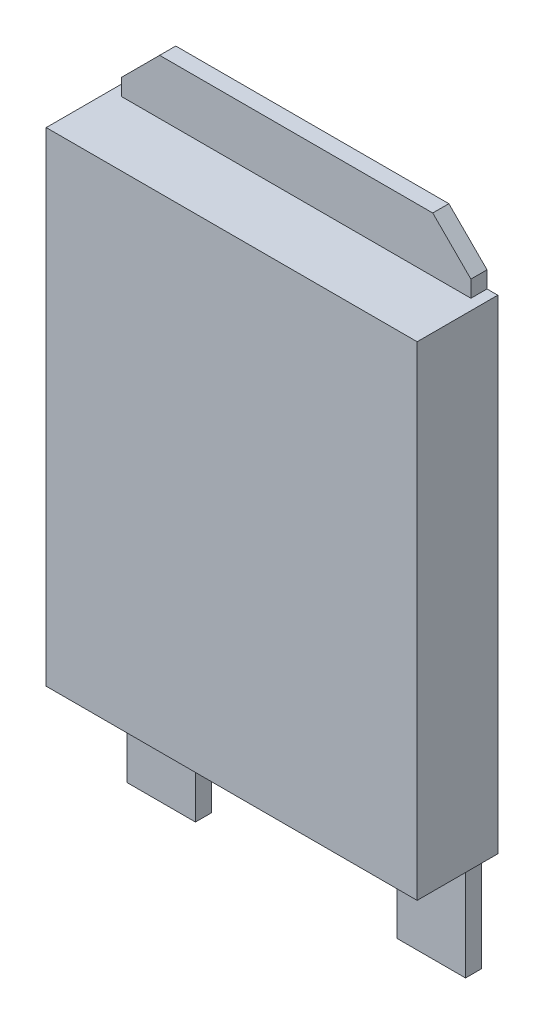
ISO-10303-21;
HEADER;
FILE_DESCRIPTION(('STEP AP214'),'2;1');
FILE_NAME('part.step','',(''),(''),'','','');
FILE_SCHEMA(('AUTOMOTIVE_DESIGN { 1 0 10303 214 1 1 1 1 }'));
ENDSEC;
DATA;
#1=APPLICATION_CONTEXT('core data for automotive mechanical design processes');
#2=APPLICATION_PROTOCOL_DEFINITION('international standard','automotive_design',2000,#1);
#3=PRODUCT_CONTEXT('',#1,'mechanical');
#4=PRODUCT('Part','Part','',(#3));
#5=PRODUCT_RELATED_PRODUCT_CATEGORY('part','',(#4));
#6=PRODUCT_DEFINITION_FORMATION('','',#4);
#7=PRODUCT_DEFINITION_CONTEXT('part definition',#1,'design');
#8=PRODUCT_DEFINITION('design','',#6,#7);
#9=PRODUCT_DEFINITION_SHAPE('','',#8);
#10=(LENGTH_UNIT() NAMED_UNIT(*) SI_UNIT(.MILLI.,.METRE.));
#11=(NAMED_UNIT(*) PLANE_ANGLE_UNIT() SI_UNIT($,.RADIAN.));
#12=(NAMED_UNIT(*) SI_UNIT($,.STERADIAN.) SOLID_ANGLE_UNIT());
#13=UNCERTAINTY_MEASURE_WITH_UNIT(LENGTH_MEASURE(1.E-05),#10,'distance_accuracy_value','');
#14=(GEOMETRIC_REPRESENTATION_CONTEXT(3) GLOBAL_UNCERTAINTY_ASSIGNED_CONTEXT((#13)) GLOBAL_UNIT_ASSIGNED_CONTEXT((#10,
#11,#12)) REPRESENTATION_CONTEXT('',''));
#15=CARTESIAN_POINT('',(0.,0.,0.));
#16=DIRECTION('',(0.,0.,1.));
#17=DIRECTION('',(1.,0.,0.));
#18=AXIS2_PLACEMENT_3D('',#15,#16,#17);
#19=CARTESIAN_POINT('',(-3.45,-4.5,1.5));
#20=DIRECTION('',(0.,1.,0.));
#21=DIRECTION('',(0.,0.,1.));
#22=AXIS2_PLACEMENT_3D('',#19,#20,#21);
#23=PLANE('',#22);
#24=DIRECTION('',(0.,0.,-1.));
#25=VECTOR('',#24,1.);
#26=CARTESIAN_POINT('',(-3.15,-4.5,0.3));
#27=LINE('',#26,#25);
#28=CARTESIAN_POINT('',(-3.15,-4.5,0.3));
#29=VERTEX_POINT('',#28);
#30=CARTESIAN_POINT('',(-3.15,-4.5,0.));
#31=VERTEX_POINT('',#30);
#32=EDGE_CURVE('E62',#29,#31,#27,.T.);
#33=ORIENTED_EDGE('',*,*,#32,.F.);
#34=DIRECTION('',(-1.,0.,0.));
#35=VECTOR('',#34,1.);
#36=CARTESIAN_POINT('',(-1.87383015994058,-4.5,0.3));
#37=LINE('',#36,#35);
#38=CARTESIAN_POINT('',(-1.87383015994058,-4.5,0.3));
#39=VERTEX_POINT('',#38);
#40=EDGE_CURVE('E57',#39,#29,#37,.T.);
#41=ORIENTED_EDGE('',*,*,#40,.F.);
#42=DIRECTION('',(0.,0.,-1.));
#43=VECTOR('',#42,1.);
#44=CARTESIAN_POINT('',(-1.87383015994058,-4.5,0.3));
#45=LINE('',#44,#43);
#46=CARTESIAN_POINT('',(-1.87383015994058,-4.5,0.));
#47=VERTEX_POINT('',#46);
#48=EDGE_CURVE('E196',#39,#47,#45,.T.);
#49=ORIENTED_EDGE('',*,*,#48,.T.);
#50=DIRECTION('',(1.,0.,0.));
#51=VECTOR('',#50,1.);
#52=CARTESIAN_POINT('',(-3.45,-4.5,0.));
#53=LINE('',#52,#51);
#54=CARTESIAN_POINT('',(1.87383015994058,-4.5,0.));
#55=VERTEX_POINT('',#54);
#56=EDGE_CURVE('E322',#47,#55,#53,.T.);
#57=ORIENTED_EDGE('',*,*,#56,.T.);
#58=DIRECTION('',(0.,0.,-1.));
#59=VECTOR('',#58,1.);
#60=CARTESIAN_POINT('',(1.87383015994058,-4.5,0.3));
#61=LINE('',#60,#59);
#62=CARTESIAN_POINT('',(1.87383015994058,-4.5,0.3));
#63=VERTEX_POINT('',#62);
#64=EDGE_CURVE('E230',#63,#55,#61,.T.);
#65=ORIENTED_EDGE('',*,*,#64,.F.);
#66=DIRECTION('',(-1.,0.,0.));
#67=VECTOR('',#66,1.);
#68=CARTESIAN_POINT('',(3.15,-4.5,0.3));
#69=LINE('',#68,#67);
#70=CARTESIAN_POINT('',(3.15,-4.5,0.3));
#71=VERTEX_POINT('',#70);
#72=EDGE_CURVE('E200',#71,#63,#69,.T.);
#73=ORIENTED_EDGE('',*,*,#72,.F.);
#74=DIRECTION('',(0.,0.,-1.));
#75=VECTOR('',#74,1.);
#76=CARTESIAN_POINT('',(3.15,-4.5,0.3));
#77=LINE('',#76,#75);
#78=CARTESIAN_POINT('',(3.15,-4.5,0.));
#79=VERTEX_POINT('',#78);
#80=EDGE_CURVE('E213',#71,#79,#77,.T.);
#81=ORIENTED_EDGE('',*,*,#80,.T.);
#82=CARTESIAN_POINT('',(3.45,-4.5,0.));
#83=VERTEX_POINT('',#82);
#84=EDGE_CURVE('E319',#79,#83,#53,.T.);
#85=ORIENTED_EDGE('',*,*,#84,.T.);
#86=DIRECTION('',(0.,0.,-1.));
#87=VECTOR('',#86,1.);
#88=CARTESIAN_POINT('',(3.45,-4.5,1.5));
#89=LINE('',#88,#87);
#90=CARTESIAN_POINT('',(3.45,-4.5,1.5));
#91=VERTEX_POINT('',#90);
#92=EDGE_CURVE('E307',#91,#83,#89,.T.);
#93=ORIENTED_EDGE('',*,*,#92,.F.);
#94=DIRECTION('',(1.,0.,0.));
#95=VECTOR('',#94,1.);
#96=CARTESIAN_POINT('',(-3.45,-4.5,1.5));
#97=LINE('',#96,#95);
#98=CARTESIAN_POINT('',(-3.45,-4.5,1.5));
#99=VERTEX_POINT('',#98);
#100=EDGE_CURVE('E304',#99,#91,#97,.T.);
#101=ORIENTED_EDGE('',*,*,#100,.F.);
#102=DIRECTION('',(0.,0.,-1.));
#103=VECTOR('',#102,1.);
#104=CARTESIAN_POINT('',(-3.45,-4.5,1.5));
#105=LINE('',#104,#103);
#106=CARTESIAN_POINT('',(-3.45,-4.5,0.));
#107=VERTEX_POINT('',#106);
#108=EDGE_CURVE('E326',#99,#107,#105,.T.);
#109=ORIENTED_EDGE('',*,*,#108,.T.);
#110=EDGE_CURVE('E298',#107,#31,#53,.T.);
#111=ORIENTED_EDGE('',*,*,#110,.T.);
#112=EDGE_LOOP('',(#33,#41,#49,#57,#65,#73,#81,#85,#93,#101,#109,#111));
#113=FACE_BOUND('',#112,.T.);
#114=ADVANCED_FACE('F41',(#113),#23,.F.);
#115=CARTESIAN_POINT('',(-3.45,4.5,1.5));
#116=DIRECTION('',(0.,-1.,0.));
#117=DIRECTION('',(0.,0.,-1.));
#118=AXIS2_PLACEMENT_3D('',#115,#116,#117);
#119=PLANE('',#118);
#120=DIRECTION('',(0.,0.,-1.));
#121=VECTOR('',#120,1.);
#122=CARTESIAN_POINT('',(3.25,4.5,0.3));
#123=LINE('',#122,#121);
#124=CARTESIAN_POINT('',(3.25,4.5,0.3));
#125=VERTEX_POINT('',#124);
#126=CARTESIAN_POINT('',(3.25,4.5,0.));
#127=VERTEX_POINT('',#126);
#128=EDGE_CURVE('E288',#125,#127,#123,.T.);
#129=ORIENTED_EDGE('',*,*,#128,.F.);
#130=DIRECTION('',(1.,0.,0.));
#131=VECTOR('',#130,1.);
#132=CARTESIAN_POINT('',(3.25,4.5,0.3));
#133=LINE('',#132,#131);
#134=CARTESIAN_POINT('',(-3.25,4.5,0.3));
#135=VERTEX_POINT('',#134);
#136=EDGE_CURVE('E235',#135,#125,#133,.T.);
#137=ORIENTED_EDGE('',*,*,#136,.F.);
#138=DIRECTION('',(0.,0.,-1.));
#139=VECTOR('',#138,1.);
#140=CARTESIAN_POINT('',(-3.25,4.5,0.3));
#141=LINE('',#140,#139);
#142=CARTESIAN_POINT('',(-3.25,4.5,0.));
#143=VERTEX_POINT('',#142);
#144=EDGE_CURVE('E255',#135,#143,#141,.T.);
#145=ORIENTED_EDGE('',*,*,#144,.T.);
#146=DIRECTION('',(-1.,0.,0.));
#147=VECTOR('',#146,1.);
#148=CARTESIAN_POINT('',(-3.45,4.5,0.));
#149=LINE('',#148,#147);
#150=CARTESIAN_POINT('',(-3.45,4.5,0.));
#151=VERTEX_POINT('',#150);
#152=EDGE_CURVE('E311',#143,#151,#149,.T.);
#153=ORIENTED_EDGE('',*,*,#152,.T.);
#154=DIRECTION('',(0.,0.,-1.));
#155=VECTOR('',#154,1.);
#156=CARTESIAN_POINT('',(-3.45,4.5,1.5));
#157=LINE('',#156,#155);
#158=CARTESIAN_POINT('',(-3.45,4.5,1.5));
#159=VERTEX_POINT('',#158);
#160=EDGE_CURVE('E50',#159,#151,#157,.T.);
#161=ORIENTED_EDGE('',*,*,#160,.F.);
#162=DIRECTION('',(-1.,0.,0.));
#163=VECTOR('',#162,1.);
#164=CARTESIAN_POINT('',(-3.45,4.5,1.5));
#165=LINE('',#164,#163);
#166=CARTESIAN_POINT('',(3.45,4.5,1.5));
#167=VERTEX_POINT('',#166);
#168=EDGE_CURVE('E297',#167,#159,#165,.T.);
#169=ORIENTED_EDGE('',*,*,#168,.F.);
#170=DIRECTION('',(0.,0.,-1.));
#171=VECTOR('',#170,1.);
#172=CARTESIAN_POINT('',(3.45,4.5,1.5));
#173=LINE('',#172,#171);
#174=CARTESIAN_POINT('',(3.45,4.5,0.));
#175=VERTEX_POINT('',#174);
#176=EDGE_CURVE('E11',#167,#175,#173,.T.);
#177=ORIENTED_EDGE('',*,*,#176,.T.);
#178=EDGE_CURVE('E312',#175,#127,#149,.T.);
#179=ORIENTED_EDGE('',*,*,#178,.T.);
#180=EDGE_LOOP('',(#129,#137,#145,#153,#161,#169,#177,#179));
#181=FACE_BOUND('',#180,.T.);
#182=ADVANCED_FACE('F384',(#181),#119,.F.);
#183=CARTESIAN_POINT('',(3.45,4.5,1.5));
#184=DIRECTION('',(-1.,0.,0.));
#185=DIRECTION('',(0.,-1.,0.));
#186=AXIS2_PLACEMENT_3D('',#183,#184,#185);
#187=PLANE('',#186);
#188=DIRECTION('',(0.,1.,0.));
#189=VECTOR('',#188,1.);
#190=CARTESIAN_POINT('',(3.45,4.5,0.));
#191=LINE('',#190,#189);
#192=EDGE_CURVE('E292',#83,#175,#191,.T.);
#193=ORIENTED_EDGE('',*,*,#192,.T.);
#194=ORIENTED_EDGE('',*,*,#176,.F.);
#195=DIRECTION('',(0.,1.,0.));
#196=VECTOR('',#195,1.);
#197=CARTESIAN_POINT('',(3.45,4.5,1.5));
#198=LINE('',#197,#196);
#199=EDGE_CURVE('E293',#91,#167,#198,.T.);
#200=ORIENTED_EDGE('',*,*,#199,.F.);
#201=ORIENTED_EDGE('',*,*,#92,.T.);
#202=EDGE_LOOP('',(#193,#194,#200,#201));
#203=FACE_BOUND('',#202,.T.);
#204=ADVANCED_FACE('F43',(#203),#187,.F.);
#205=CARTESIAN_POINT('',(-3.45,4.5,1.5));
#206=DIRECTION('',(1.,0.,0.));
#207=DIRECTION('',(0.,1.,0.));
#208=AXIS2_PLACEMENT_3D('',#205,#206,#207);
#209=PLANE('',#208);
#210=DIRECTION('',(0.,-1.,0.));
#211=VECTOR('',#210,1.);
#212=CARTESIAN_POINT('',(-3.45,4.5,0.));
#213=LINE('',#212,#211);
#214=EDGE_CURVE('E316',#151,#107,#213,.T.);
#215=ORIENTED_EDGE('',*,*,#214,.T.);
#216=ORIENTED_EDGE('',*,*,#108,.F.);
#217=DIRECTION('',(0.,-1.,0.));
#218=VECTOR('',#217,1.);
#219=CARTESIAN_POINT('',(-3.45,4.5,1.5));
#220=LINE('',#219,#218);
#221=EDGE_CURVE('E301',#159,#99,#220,.T.);
#222=ORIENTED_EDGE('',*,*,#221,.F.);
#223=ORIENTED_EDGE('',*,*,#160,.T.);
#224=EDGE_LOOP('',(#215,#216,#222,#223));
#225=FACE_BOUND('',#224,.T.);
#226=ADVANCED_FACE('F335',(#225),#209,.F.);
#227=CARTESIAN_POINT('',(0.,0.,1.5));
#228=DIRECTION('',(0.,0.,1.));
#229=DIRECTION('',(1.,0.,0.));
#230=AXIS2_PLACEMENT_3D('',#227,#228,#229);
#231=PLANE('',#230);
#232=ORIENTED_EDGE('',*,*,#199,.T.);
#233=ORIENTED_EDGE('',*,*,#168,.T.);
#234=ORIENTED_EDGE('',*,*,#221,.T.);
#235=ORIENTED_EDGE('',*,*,#100,.T.);
#236=EDGE_LOOP('',(#232,#233,#234,#235));
#237=FACE_BOUND('',#236,.T.);
#238=ADVANCED_FACE('F412',(#237),#231,.T.);
#239=CARTESIAN_POINT('',(0.,0.,0.));
#240=DIRECTION('',(0.,0.,1.));
#241=DIRECTION('',(1.,0.,0.));
#242=AXIS2_PLACEMENT_3D('',#239,#240,#241);
#243=PLANE('',#242);
#244=ORIENTED_EDGE('',*,*,#192,.F.);
#245=ORIENTED_EDGE('',*,*,#84,.F.);
#246=DIRECTION('',(0.,1.,0.));
#247=VECTOR('',#246,1.);
#248=CARTESIAN_POINT('',(3.15,-4.5,0.));
#249=LINE('',#248,#247);
#250=CARTESIAN_POINT('',(3.15,-6.5,0.));
#251=VERTEX_POINT('',#250);
#252=EDGE_CURVE('E205',#251,#79,#249,.T.);
#253=ORIENTED_EDGE('',*,*,#252,.F.);
#254=DIRECTION('',(1.,0.,0.));
#255=VECTOR('',#254,1.);
#256=CARTESIAN_POINT('',(3.15,-6.5,0.));
#257=LINE('',#256,#255);
#258=CARTESIAN_POINT('',(1.87383015994058,-6.5,0.));
#259=VERTEX_POINT('',#258);
#260=EDGE_CURVE('E194',#259,#251,#257,.T.);
#261=ORIENTED_EDGE('',*,*,#260,.F.);
#262=DIRECTION('',(0.,-1.,0.));
#263=VECTOR('',#262,1.);
#264=CARTESIAN_POINT('',(1.87383015994058,-6.5,0.));
#265=LINE('',#264,#263);
#266=EDGE_CURVE('E190',#55,#259,#265,.T.);
#267=ORIENTED_EDGE('',*,*,#266,.F.);
#268=ORIENTED_EDGE('',*,*,#56,.F.);
#269=DIRECTION('',(0.,1.,0.));
#270=VECTOR('',#269,1.);
#271=CARTESIAN_POINT('',(-1.87383015994058,-6.5,0.));
#272=LINE('',#271,#270);
#273=CARTESIAN_POINT('',(-1.87383015994058,-6.5,0.));
#274=VERTEX_POINT('',#273);
#275=EDGE_CURVE('E184',#274,#47,#272,.T.);
#276=ORIENTED_EDGE('',*,*,#275,.F.);
#277=DIRECTION('',(1.,0.,0.));
#278=VECTOR('',#277,1.);
#279=CARTESIAN_POINT('',(-3.15,-6.5,0.));
#280=LINE('',#279,#278);
#281=CARTESIAN_POINT('',(-3.15,-6.5,0.));
#282=VERTEX_POINT('',#281);
#283=EDGE_CURVE('E354',#282,#274,#280,.T.);
#284=ORIENTED_EDGE('',*,*,#283,.F.);
#285=DIRECTION('',(0.,-1.,0.));
#286=VECTOR('',#285,1.);
#287=CARTESIAN_POINT('',(-3.15,-4.5,0.));
#288=LINE('',#287,#286);
#289=EDGE_CURVE('E188',#31,#282,#288,.T.);
#290=ORIENTED_EDGE('',*,*,#289,.F.);
#291=ORIENTED_EDGE('',*,*,#110,.F.);
#292=ORIENTED_EDGE('',*,*,#214,.F.);
#293=ORIENTED_EDGE('',*,*,#152,.F.);
#294=DIRECTION('',(0.,-1.,0.));
#295=VECTOR('',#294,1.);
#296=CARTESIAN_POINT('',(-3.25,4.808852059339,0.));
#297=LINE('',#296,#295);
#298=CARTESIAN_POINT('',(-3.25,4.808852059339,0.));
#299=VERTEX_POINT('',#298);
#300=EDGE_CURVE('E240',#299,#143,#297,.T.);
#301=ORIENTED_EDGE('',*,*,#300,.F.);
#302=DIRECTION('',(-0.707106781186547,-0.707106781186547,0.));
#303=VECTOR('',#302,1.);
#304=CARTESIAN_POINT('',(-2.54,5.518852059339,0.));
#305=LINE('',#304,#303);
#306=CARTESIAN_POINT('',(-2.54,5.518852059339,0.));
#307=VERTEX_POINT('',#306);
#308=EDGE_CURVE('E264',#307,#299,#305,.T.);
#309=ORIENTED_EDGE('',*,*,#308,.F.);
#310=DIRECTION('',(-1.,0.,0.));
#311=VECTOR('',#310,1.);
#312=CARTESIAN_POINT('',(2.54,5.518852059339,0.));
#313=LINE('',#312,#311);
#314=CARTESIAN_POINT('',(2.54,5.518852059339,0.));
#315=VERTEX_POINT('',#314);
#316=EDGE_CURVE('E261',#315,#307,#313,.T.);
#317=ORIENTED_EDGE('',*,*,#316,.F.);
#318=DIRECTION('',(-0.707106781186548,0.707106781186547,0.));
#319=VECTOR('',#318,1.);
#320=CARTESIAN_POINT('',(3.25,4.808852059339,0.));
#321=LINE('',#320,#319);
#322=CARTESIAN_POINT('',(3.25,4.808852059339,0.));
#323=VERTEX_POINT('',#322);
#324=EDGE_CURVE('E258',#323,#315,#321,.T.);
#325=ORIENTED_EDGE('',*,*,#324,.F.);
#326=DIRECTION('',(0.,1.,0.));
#327=VECTOR('',#326,1.);
#328=CARTESIAN_POINT('',(3.25,4.5,0.));
#329=LINE('',#328,#327);
#330=EDGE_CURVE('E234',#127,#323,#329,.T.);
#331=ORIENTED_EDGE('',*,*,#330,.F.);
#332=ORIENTED_EDGE('',*,*,#178,.F.);
#333=EDGE_LOOP('',(#244,#245,#253,#261,#267,#268,#276,#284,#290,#291,#292,#293,#301,#309,#317,
#325,#331,#332));
#334=FACE_BOUND('',#333,.T.);
#335=ADVANCED_FACE('F342',(#334),#243,.F.);
#336=CARTESIAN_POINT('',(3.25,4.5,0.3));
#337=DIRECTION('',(-1.,0.,0.));
#338=DIRECTION('',(0.,0.,1.));
#339=AXIS2_PLACEMENT_3D('',#336,#337,#338);
#340=PLANE('',#339);
#341=ORIENTED_EDGE('',*,*,#330,.T.);
#342=DIRECTION('',(0.,0.,-1.));
#343=VECTOR('',#342,1.);
#344=CARTESIAN_POINT('',(3.25,4.808852059339,0.3));
#345=LINE('',#344,#343);
#346=CARTESIAN_POINT('',(3.25,4.808852059339,0.3));
#347=VERTEX_POINT('',#346);
#348=EDGE_CURVE('E284',#347,#323,#345,.T.);
#349=ORIENTED_EDGE('',*,*,#348,.F.);
#350=DIRECTION('',(0.,1.,0.));
#351=VECTOR('',#350,1.);
#352=CARTESIAN_POINT('',(3.25,4.5,0.3));
#353=LINE('',#352,#351);
#354=EDGE_CURVE('E239',#125,#347,#353,.T.);
#355=ORIENTED_EDGE('',*,*,#354,.F.);
#356=ORIENTED_EDGE('',*,*,#128,.T.);
#357=EDGE_LOOP('',(#341,#349,#355,#356));
#358=FACE_BOUND('',#357,.T.);
#359=ADVANCED_FACE('F407',(#358),#340,.F.);
#360=CARTESIAN_POINT('',(3.25,4.808852059339,0.3));
#361=DIRECTION('',(-0.707106781186547,-0.707106781186548,0.));
#362=DIRECTION('',(0.707106781186548,-0.707106781186547,0.));
#363=AXIS2_PLACEMENT_3D('',#360,#361,#362);
#364=PLANE('',#363);
#365=ORIENTED_EDGE('',*,*,#324,.T.);
#366=DIRECTION('',(0.,0.,-1.));
#367=VECTOR('',#366,1.);
#368=CARTESIAN_POINT('',(2.54,5.518852059339,0.3));
#369=LINE('',#368,#367);
#370=CARTESIAN_POINT('',(2.54,5.518852059339,0.3));
#371=VERTEX_POINT('',#370);
#372=EDGE_CURVE('E280',#371,#315,#369,.T.);
#373=ORIENTED_EDGE('',*,*,#372,.F.);
#374=DIRECTION('',(-0.707106781186548,0.707106781186547,0.));
#375=VECTOR('',#374,1.);
#376=CARTESIAN_POINT('',(3.25,4.808852059339,0.3));
#377=LINE('',#376,#375);
#378=EDGE_CURVE('E243',#347,#371,#377,.T.);
#379=ORIENTED_EDGE('',*,*,#378,.F.);
#380=ORIENTED_EDGE('',*,*,#348,.T.);
#381=EDGE_LOOP('',(#365,#373,#379,#380));
#382=FACE_BOUND('',#381,.T.);
#383=ADVANCED_FACE('F404',(#382),#364,.F.);
#384=CARTESIAN_POINT('',(2.54,5.518852059339,0.3));
#385=DIRECTION('',(0.,-1.,0.));
#386=DIRECTION('',(0.,0.,-1.));
#387=AXIS2_PLACEMENT_3D('',#384,#385,#386);
#388=PLANE('',#387);
#389=ORIENTED_EDGE('',*,*,#316,.T.);
#390=DIRECTION('',(0.,0.,-1.));
#391=VECTOR('',#390,1.);
#392=CARTESIAN_POINT('',(-2.54,5.518852059339,0.3));
#393=LINE('',#392,#391);
#394=CARTESIAN_POINT('',(-2.54,5.518852059339,0.3));
#395=VERTEX_POINT('',#394);
#396=EDGE_CURVE('E276',#395,#307,#393,.T.);
#397=ORIENTED_EDGE('',*,*,#396,.F.);
#398=DIRECTION('',(-1.,0.,0.));
#399=VECTOR('',#398,1.);
#400=CARTESIAN_POINT('',(2.54,5.518852059339,0.3));
#401=LINE('',#400,#399);
#402=EDGE_CURVE('E246',#371,#395,#401,.T.);
#403=ORIENTED_EDGE('',*,*,#402,.F.);
#404=ORIENTED_EDGE('',*,*,#372,.T.);
#405=EDGE_LOOP('',(#389,#397,#403,#404));
#406=FACE_BOUND('',#405,.T.);
#407=ADVANCED_FACE('F400',(#406),#388,.F.);
#408=CARTESIAN_POINT('',(-2.54,5.518852059339,0.3));
#409=DIRECTION('',(0.707106781186547,-0.707106781186547,0.));
#410=DIRECTION('',(0.707106781186548,0.707106781186548,0.));
#411=AXIS2_PLACEMENT_3D('',#408,#409,#410);
#412=PLANE('',#411);
#413=ORIENTED_EDGE('',*,*,#308,.T.);
#414=DIRECTION('',(0.,0.,-1.));
#415=VECTOR('',#414,1.);
#416=CARTESIAN_POINT('',(-3.25,4.808852059339,0.3));
#417=LINE('',#416,#415);
#418=CARTESIAN_POINT('',(-3.25,4.808852059339,0.3));
#419=VERTEX_POINT('',#418);
#420=EDGE_CURVE('E272',#419,#299,#417,.T.);
#421=ORIENTED_EDGE('',*,*,#420,.F.);
#422=DIRECTION('',(-0.707106781186547,-0.707106781186547,0.));
#423=VECTOR('',#422,1.);
#424=CARTESIAN_POINT('',(-2.54,5.518852059339,0.3));
#425=LINE('',#424,#423);
#426=EDGE_CURVE('E249',#395,#419,#425,.T.);
#427=ORIENTED_EDGE('',*,*,#426,.F.);
#428=ORIENTED_EDGE('',*,*,#396,.T.);
#429=EDGE_LOOP('',(#413,#421,#427,#428));
#430=FACE_BOUND('',#429,.T.);
#431=ADVANCED_FACE('F395',(#430),#412,.F.);
#432=CARTESIAN_POINT('',(-3.25,4.808852059339,0.3));
#433=DIRECTION('',(1.,0.,0.));
#434=DIRECTION('',(0.,0.,-1.));
#435=AXIS2_PLACEMENT_3D('',#432,#433,#434);
#436=PLANE('',#435);
#437=ORIENTED_EDGE('',*,*,#300,.T.);
#438=ORIENTED_EDGE('',*,*,#144,.F.);
#439=DIRECTION('',(0.,-1.,0.));
#440=VECTOR('',#439,1.);
#441=CARTESIAN_POINT('',(-3.25,4.808852059339,0.3));
#442=LINE('',#441,#440);
#443=EDGE_CURVE('E252',#419,#135,#442,.T.);
#444=ORIENTED_EDGE('',*,*,#443,.F.);
#445=ORIENTED_EDGE('',*,*,#420,.T.);
#446=EDGE_LOOP('',(#437,#438,#444,#445));
#447=FACE_BOUND('',#446,.T.);
#448=ADVANCED_FACE('F389',(#447),#436,.F.);
#449=CARTESIAN_POINT('',(0.,0.,0.3));
#450=DIRECTION('',(0.,0.,1.));
#451=DIRECTION('',(1.,0.,0.));
#452=AXIS2_PLACEMENT_3D('',#449,#450,#451);
#453=PLANE('',#452);
#454=ORIENTED_EDGE('',*,*,#136,.T.);
#455=ORIENTED_EDGE('',*,*,#354,.T.);
#456=ORIENTED_EDGE('',*,*,#378,.T.);
#457=ORIENTED_EDGE('',*,*,#402,.T.);
#458=ORIENTED_EDGE('',*,*,#426,.T.);
#459=ORIENTED_EDGE('',*,*,#443,.T.);
#460=EDGE_LOOP('',(#454,#455,#456,#457,#458,#459));
#461=FACE_BOUND('',#460,.T.);
#462=ADVANCED_FACE('F497',(#461),#453,.T.);
#463=CARTESIAN_POINT('',(1.87383015994058,-6.5,0.3));
#464=DIRECTION('',(1.,0.,0.));
#465=DIRECTION('',(0.,1.,0.));
#466=AXIS2_PLACEMENT_3D('',#463,#464,#465);
#467=PLANE('',#466);
#468=ORIENTED_EDGE('',*,*,#266,.T.);
#469=DIRECTION('',(0.,0.,-1.));
#470=VECTOR('',#469,1.);
#471=CARTESIAN_POINT('',(1.87383015994058,-6.5,0.3));
#472=LINE('',#471,#470);
#473=CARTESIAN_POINT('',(1.87383015994058,-6.5,0.3));
#474=VERTEX_POINT('',#473);
#475=EDGE_CURVE('E226',#474,#259,#472,.T.);
#476=ORIENTED_EDGE('',*,*,#475,.F.);
#477=DIRECTION('',(0.,-1.,0.));
#478=VECTOR('',#477,1.);
#479=CARTESIAN_POINT('',(1.87383015994058,-6.5,0.3));
#480=LINE('',#479,#478);
#481=EDGE_CURVE('E204',#63,#474,#480,.T.);
#482=ORIENTED_EDGE('',*,*,#481,.F.);
#483=ORIENTED_EDGE('',*,*,#64,.T.);
#484=EDGE_LOOP('',(#468,#476,#482,#483));
#485=FACE_BOUND('',#484,.T.);
#486=ADVANCED_FACE('F372',(#485),#467,.F.);
#487=CARTESIAN_POINT('',(3.15,-6.5,0.3));
#488=DIRECTION('',(0.,1.,0.));
#489=DIRECTION('',(0.,0.,1.));
#490=AXIS2_PLACEMENT_3D('',#487,#488,#489);
#491=PLANE('',#490);
#492=ORIENTED_EDGE('',*,*,#260,.T.);
#493=DIRECTION('',(0.,0.,-1.));
#494=VECTOR('',#493,1.);
#495=CARTESIAN_POINT('',(3.15,-6.5,0.3));
#496=LINE('',#495,#494);
#497=CARTESIAN_POINT('',(3.15,-6.5,0.3));
#498=VERTEX_POINT('',#497);
#499=EDGE_CURVE('E222',#498,#251,#496,.T.);
#500=ORIENTED_EDGE('',*,*,#499,.F.);
#501=DIRECTION('',(1.,0.,0.));
#502=VECTOR('',#501,1.);
#503=CARTESIAN_POINT('',(3.15,-6.5,0.3));
#504=LINE('',#503,#502);
#505=EDGE_CURVE('E208',#474,#498,#504,.T.);
#506=ORIENTED_EDGE('',*,*,#505,.F.);
#507=ORIENTED_EDGE('',*,*,#475,.T.);
#508=EDGE_LOOP('',(#492,#500,#506,#507));
#509=FACE_BOUND('',#508,.T.);
#510=ADVANCED_FACE('F516',(#509),#491,.F.);
#511=CARTESIAN_POINT('',(3.15,-4.5,0.3));
#512=DIRECTION('',(-1.,0.,0.));
#513=DIRECTION('',(0.,0.,1.));
#514=AXIS2_PLACEMENT_3D('',#511,#512,#513);
#515=PLANE('',#514);
#516=ORIENTED_EDGE('',*,*,#252,.T.);
#517=ORIENTED_EDGE('',*,*,#80,.F.);
#518=DIRECTION('',(0.,1.,0.));
#519=VECTOR('',#518,1.);
#520=CARTESIAN_POINT('',(3.15,-4.5,0.3));
#521=LINE('',#520,#519);
#522=EDGE_CURVE('E211',#498,#71,#521,.T.);
#523=ORIENTED_EDGE('',*,*,#522,.F.);
#524=ORIENTED_EDGE('',*,*,#499,.T.);
#525=EDGE_LOOP('',(#516,#517,#523,#524));
#526=FACE_BOUND('',#525,.T.);
#527=ADVANCED_FACE('F525',(#526),#515,.F.);
#528=CARTESIAN_POINT('',(0.,0.,0.3));
#529=DIRECTION('',(0.,0.,-1.));
#530=DIRECTION('',(-1.,0.,0.));
#531=AXIS2_PLACEMENT_3D('',#528,#529,#530);
#532=PLANE('',#531);
#533=ORIENTED_EDGE('',*,*,#72,.T.);
#534=ORIENTED_EDGE('',*,*,#481,.T.);
#535=ORIENTED_EDGE('',*,*,#505,.T.);
#536=ORIENTED_EDGE('',*,*,#522,.T.);
#537=EDGE_LOOP('',(#533,#534,#535,#536));
#538=FACE_BOUND('',#537,.T.);
#539=ADVANCED_FACE('F375',(#538),#532,.F.);
#540=CARTESIAN_POINT('',(-3.15,-4.5,0.3));
#541=DIRECTION('',(1.,0.,0.));
#542=DIRECTION('',(0.,0.,-1.));
#543=AXIS2_PLACEMENT_3D('',#540,#541,#542);
#544=PLANE('',#543);
#545=ORIENTED_EDGE('',*,*,#289,.T.);
#546=DIRECTION('',(0.,0.,-1.));
#547=VECTOR('',#546,1.);
#548=CARTESIAN_POINT('',(-3.15,-6.5,0.3));
#549=LINE('',#548,#547);
#550=CARTESIAN_POINT('',(-3.15,-6.5,0.3));
#551=VERTEX_POINT('',#550);
#552=EDGE_CURVE('E170',#551,#282,#549,.T.);
#553=ORIENTED_EDGE('',*,*,#552,.F.);
#554=DIRECTION('',(0.,-1.,0.));
#555=VECTOR('',#554,1.);
#556=CARTESIAN_POINT('',(-3.15,-4.5,0.3));
#557=LINE('',#556,#555);
#558=EDGE_CURVE('E178',#29,#551,#557,.T.);
#559=ORIENTED_EDGE('',*,*,#558,.F.);
#560=ORIENTED_EDGE('',*,*,#32,.T.);
#561=EDGE_LOOP('',(#545,#553,#559,#560));
#562=FACE_BOUND('',#561,.T.);
#563=ADVANCED_FACE('F186',(#562),#544,.F.);
#564=CARTESIAN_POINT('',(-3.15,-6.5,0.3));
#565=DIRECTION('',(0.,1.,0.));
#566=DIRECTION('',(0.,0.,1.));
#567=AXIS2_PLACEMENT_3D('',#564,#565,#566);
#568=PLANE('',#567);
#569=ORIENTED_EDGE('',*,*,#283,.T.);
#570=DIRECTION('',(0.,0.,-1.));
#571=VECTOR('',#570,1.);
#572=CARTESIAN_POINT('',(-1.87383015994058,-6.5,0.3));
#573=LINE('',#572,#571);
#574=CARTESIAN_POINT('',(-1.87383015994058,-6.5,0.3));
#575=VERTEX_POINT('',#574);
#576=EDGE_CURVE('E173',#575,#274,#573,.T.);
#577=ORIENTED_EDGE('',*,*,#576,.F.);
#578=DIRECTION('',(1.,0.,0.));
#579=VECTOR('',#578,1.);
#580=CARTESIAN_POINT('',(-3.15,-6.5,0.3));
#581=LINE('',#580,#579);
#582=EDGE_CURVE('E166',#551,#575,#581,.T.);
#583=ORIENTED_EDGE('',*,*,#582,.F.);
#584=ORIENTED_EDGE('',*,*,#552,.T.);
#585=EDGE_LOOP('',(#569,#577,#583,#584));
#586=FACE_BOUND('',#585,.T.);
#587=ADVANCED_FACE('F168',(#586),#568,.F.);
#588=CARTESIAN_POINT('',(-1.87383015994058,-6.5,0.3));
#589=DIRECTION('',(-1.,0.,0.));
#590=DIRECTION('',(0.,-1.,0.));
#591=AXIS2_PLACEMENT_3D('',#588,#589,#590);
#592=PLANE('',#591);
#593=ORIENTED_EDGE('',*,*,#275,.T.);
#594=ORIENTED_EDGE('',*,*,#48,.F.);
#595=DIRECTION('',(0.,1.,0.));
#596=VECTOR('',#595,1.);
#597=CARTESIAN_POINT('',(-1.87383015994058,-6.5,0.3));
#598=LINE('',#597,#596);
#599=EDGE_CURVE('E177',#575,#39,#598,.T.);
#600=ORIENTED_EDGE('',*,*,#599,.F.);
#601=ORIENTED_EDGE('',*,*,#576,.T.);
#602=EDGE_LOOP('',(#593,#594,#600,#601));
#603=FACE_BOUND('',#602,.T.);
#604=ADVANCED_FACE('F362',(#603),#592,.F.);
#605=CARTESIAN_POINT('',(0.,0.,0.3));
#606=DIRECTION('',(0.,0.,1.));
#607=DIRECTION('',(1.,0.,0.));
#608=AXIS2_PLACEMENT_3D('',#605,#606,#607);
#609=PLANE('',#608);
#610=ORIENTED_EDGE('',*,*,#558,.T.);
#611=ORIENTED_EDGE('',*,*,#582,.T.);
#612=ORIENTED_EDGE('',*,*,#599,.T.);
#613=ORIENTED_EDGE('',*,*,#40,.T.);
#614=EDGE_LOOP('',(#610,#611,#612,#613));
#615=FACE_BOUND('',#614,.T.);
#616=ADVANCED_FACE('F181',(#615),#609,.T.);
#617=CLOSED_SHELL('',(#114,#182,#204,#226,#238,#335,#359,#383,#407,#431,#448,#462,#486,#510,
#527,#539,#563,#587,#604,#616));
#618=MANIFOLD_SOLID_BREP('B2',#617);
#619=ADVANCED_BREP_SHAPE_REPRESENTATION('',(#18,#618),#14);
#620=SHAPE_DEFINITION_REPRESENTATION(#9,#619);
ENDSEC;
END-ISO-10303-21;
